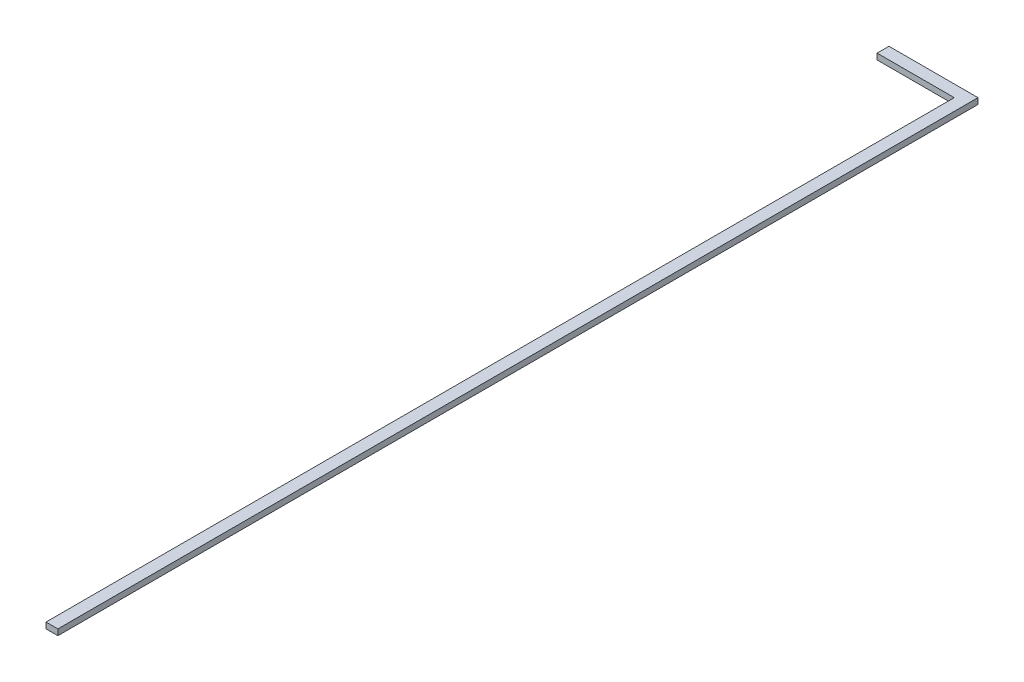
ISO-10303-21;
HEADER;
FILE_DESCRIPTION(('STEP AP214'),'2;1');
FILE_NAME('part.step','',(''),(''),'','','');
FILE_SCHEMA(('AUTOMOTIVE_DESIGN { 1 0 10303 214 1 1 1 1 }'));
ENDSEC;
DATA;
#1=APPLICATION_CONTEXT('core data for automotive mechanical design processes');
#2=APPLICATION_PROTOCOL_DEFINITION('international standard','automotive_design',2000,#1);
#3=PRODUCT_CONTEXT('',#1,'mechanical');
#4=PRODUCT('Part','Part','',(#3));
#5=PRODUCT_RELATED_PRODUCT_CATEGORY('part','',(#4));
#6=PRODUCT_DEFINITION_FORMATION('','',#4);
#7=PRODUCT_DEFINITION_CONTEXT('part definition',#1,'design');
#8=PRODUCT_DEFINITION('design','',#6,#7);
#9=PRODUCT_DEFINITION_SHAPE('','',#8);
#10=(LENGTH_UNIT() NAMED_UNIT(*) SI_UNIT(.MILLI.,.METRE.));
#11=(NAMED_UNIT(*) PLANE_ANGLE_UNIT() SI_UNIT($,.RADIAN.));
#12=(NAMED_UNIT(*) SI_UNIT($,.STERADIAN.) SOLID_ANGLE_UNIT());
#13=UNCERTAINTY_MEASURE_WITH_UNIT(LENGTH_MEASURE(1.E-05),#10,'distance_accuracy_value','');
#14=(GEOMETRIC_REPRESENTATION_CONTEXT(3) GLOBAL_UNCERTAINTY_ASSIGNED_CONTEXT((#13)) GLOBAL_UNIT_ASSIGNED_CONTEXT((#10,
#11,#12)) REPRESENTATION_CONTEXT('',''));
#15=CARTESIAN_POINT('',(0.,0.,0.));
#16=DIRECTION('',(0.,0.,1.));
#17=DIRECTION('',(1.,0.,0.));
#18=AXIS2_PLACEMENT_3D('',#15,#16,#17);
#19=CARTESIAN_POINT('',(0.,10.,0.));
#20=DIRECTION('',(0.,0.,-1.));
#21=DIRECTION('',(-1.,0.,0.));
#22=AXIS2_PLACEMENT_3D('',#19,#20,#21);
#23=PLANE('',#22);
#24=DIRECTION('',(1.,0.,0.));
#25=VECTOR('',#24,1.);
#26=CARTESIAN_POINT('',(0.,0.,0.));
#27=LINE('',#26,#25);
#28=CARTESIAN_POINT('',(0.,0.,0.));
#29=VERTEX_POINT('',#28);
#30=CARTESIAN_POINT('',(130.,0.,0.));
#31=VERTEX_POINT('',#30);
#32=EDGE_CURVE('E115',#29,#31,#27,.T.);
#33=ORIENTED_EDGE('',*,*,#32,.T.);
#34=DIRECTION('',(0.,-1.,0.));
#35=VECTOR('',#34,1.);
#36=CARTESIAN_POINT('',(130.,10.,0.));
#37=LINE('',#36,#35);
#38=CARTESIAN_POINT('',(130.,10.,0.));
#39=VERTEX_POINT('',#38);
#40=EDGE_CURVE('E11',#39,#31,#37,.T.);
#41=ORIENTED_EDGE('',*,*,#40,.F.);
#42=DIRECTION('',(1.,0.,0.));
#43=VECTOR('',#42,1.);
#44=CARTESIAN_POINT('',(0.,10.,0.));
#45=LINE('',#44,#43);
#46=CARTESIAN_POINT('',(0.,10.,0.));
#47=VERTEX_POINT('',#46);
#48=EDGE_CURVE('E125',#47,#39,#45,.T.);
#49=ORIENTED_EDGE('',*,*,#48,.F.);
#50=DIRECTION('',(0.,-1.,0.));
#51=VECTOR('',#50,1.);
#52=CARTESIAN_POINT('',(0.,10.,0.));
#53=LINE('',#52,#51);
#54=EDGE_CURVE('E111',#47,#29,#53,.T.);
#55=ORIENTED_EDGE('',*,*,#54,.T.);
#56=EDGE_LOOP('',(#33,#41,#49,#55));
#57=FACE_BOUND('',#56,.T.);
#58=ADVANCED_FACE('F31',(#57),#23,.F.);
#59=CARTESIAN_POINT('',(130.,10.,0.));
#60=DIRECTION('',(1.,0.,0.));
#61=DIRECTION('',(0.,0.,-1.));
#62=AXIS2_PLACEMENT_3D('',#59,#60,#61);
#63=PLANE('',#62);
#64=DIRECTION('',(0.,0.,1.));
#65=VECTOR('',#64,1.);
#66=CARTESIAN_POINT('',(130.,0.,0.));
#67=LINE('',#66,#65);
#68=CARTESIAN_POINT('',(130.,0.,1530.));
#69=VERTEX_POINT('',#68);
#70=EDGE_CURVE('E118',#31,#69,#67,.T.);
#71=ORIENTED_EDGE('',*,*,#70,.T.);
#72=DIRECTION('',(0.,-1.,0.));
#73=VECTOR('',#72,1.);
#74=CARTESIAN_POINT('',(130.,10.,1530.));
#75=LINE('',#74,#73);
#76=CARTESIAN_POINT('',(130.,10.,1530.));
#77=VERTEX_POINT('',#76);
#78=EDGE_CURVE('E39',#77,#69,#75,.T.);
#79=ORIENTED_EDGE('',*,*,#78,.F.);
#80=DIRECTION('',(0.,0.,1.));
#81=VECTOR('',#80,1.);
#82=CARTESIAN_POINT('',(130.,10.,0.));
#83=LINE('',#82,#81);
#84=EDGE_CURVE('E84',#39,#77,#83,.T.);
#85=ORIENTED_EDGE('',*,*,#84,.F.);
#86=ORIENTED_EDGE('',*,*,#40,.T.);
#87=EDGE_LOOP('',(#71,#79,#85,#86));
#88=FACE_BOUND('',#87,.T.);
#89=ADVANCED_FACE('F149',(#88),#63,.F.);
#90=CARTESIAN_POINT('',(130.,10.,1530.));
#91=DIRECTION('',(0.,0.,-1.));
#92=DIRECTION('',(-1.,0.,0.));
#93=AXIS2_PLACEMENT_3D('',#90,#91,#92);
#94=PLANE('',#93);
#95=DIRECTION('',(1.,0.,0.));
#96=VECTOR('',#95,1.);
#97=CARTESIAN_POINT('',(130.,0.,1530.));
#98=LINE('',#97,#96);
#99=CARTESIAN_POINT('',(150.,0.,1530.));
#100=VERTEX_POINT('',#99);
#101=EDGE_CURVE('E120',#69,#100,#98,.T.);
#102=ORIENTED_EDGE('',*,*,#101,.T.);
#103=DIRECTION('',(0.,-1.,0.));
#104=VECTOR('',#103,1.);
#105=CARTESIAN_POINT('',(150.,10.,1530.));
#106=LINE('',#105,#104);
#107=CARTESIAN_POINT('',(150.,10.,1530.));
#108=VERTEX_POINT('',#107);
#109=EDGE_CURVE('E106',#108,#100,#106,.T.);
#110=ORIENTED_EDGE('',*,*,#109,.F.);
#111=DIRECTION('',(1.,0.,0.));
#112=VECTOR('',#111,1.);
#113=CARTESIAN_POINT('',(130.,10.,1530.));
#114=LINE('',#113,#112);
#115=EDGE_CURVE('E97',#77,#108,#114,.T.);
#116=ORIENTED_EDGE('',*,*,#115,.F.);
#117=ORIENTED_EDGE('',*,*,#78,.T.);
#118=EDGE_LOOP('',(#102,#110,#116,#117));
#119=FACE_BOUND('',#118,.T.);
#120=ADVANCED_FACE('F131',(#119),#94,.F.);
#121=CARTESIAN_POINT('',(150.,10.,-20.));
#122=DIRECTION('',(-1.,0.,0.));
#123=DIRECTION('',(0.,0.,1.));
#124=AXIS2_PLACEMENT_3D('',#121,#122,#123);
#125=PLANE('',#124);
#126=DIRECTION('',(0.,0.,-1.));
#127=VECTOR('',#126,1.);
#128=CARTESIAN_POINT('',(150.,0.,-20.));
#129=LINE('',#128,#127);
#130=CARTESIAN_POINT('',(150.,0.,-20.));
#131=VERTEX_POINT('',#130);
#132=EDGE_CURVE('E105',#100,#131,#129,.T.);
#133=ORIENTED_EDGE('',*,*,#132,.T.);
#134=DIRECTION('',(0.,-1.,0.));
#135=VECTOR('',#134,1.);
#136=CARTESIAN_POINT('',(150.,10.,-20.));
#137=LINE('',#136,#135);
#138=CARTESIAN_POINT('',(150.,10.,-20.));
#139=VERTEX_POINT('',#138);
#140=EDGE_CURVE('E102',#139,#131,#137,.T.);
#141=ORIENTED_EDGE('',*,*,#140,.F.);
#142=DIRECTION('',(0.,0.,-1.));
#143=VECTOR('',#142,1.);
#144=CARTESIAN_POINT('',(150.,10.,-20.));
#145=LINE('',#144,#143);
#146=EDGE_CURVE('E91',#108,#139,#145,.T.);
#147=ORIENTED_EDGE('',*,*,#146,.F.);
#148=ORIENTED_EDGE('',*,*,#109,.T.);
#149=EDGE_LOOP('',(#133,#141,#147,#148));
#150=FACE_BOUND('',#149,.T.);
#151=ADVANCED_FACE('F103',(#150),#125,.F.);
#152=CARTESIAN_POINT('',(0.,10.,-20.));
#153=DIRECTION('',(0.,0.,1.));
#154=DIRECTION('',(1.,0.,0.));
#155=AXIS2_PLACEMENT_3D('',#152,#153,#154);
#156=PLANE('',#155);
#157=DIRECTION('',(-1.,0.,0.));
#158=VECTOR('',#157,1.);
#159=CARTESIAN_POINT('',(0.,0.,-20.));
#160=LINE('',#159,#158);
#161=CARTESIAN_POINT('',(0.,0.,-20.));
#162=VERTEX_POINT('',#161);
#163=EDGE_CURVE('E70',#131,#162,#160,.T.);
#164=ORIENTED_EDGE('',*,*,#163,.T.);
#165=DIRECTION('',(0.,-1.,0.));
#166=VECTOR('',#165,1.);
#167=CARTESIAN_POINT('',(0.,10.,-20.));
#168=LINE('',#167,#166);
#169=CARTESIAN_POINT('',(0.,10.,-20.));
#170=VERTEX_POINT('',#169);
#171=EDGE_CURVE('E107',#170,#162,#168,.T.);
#172=ORIENTED_EDGE('',*,*,#171,.F.);
#173=DIRECTION('',(-1.,0.,0.));
#174=VECTOR('',#173,1.);
#175=CARTESIAN_POINT('',(0.,10.,-20.));
#176=LINE('',#175,#174);
#177=EDGE_CURVE('E95',#139,#170,#176,.T.);
#178=ORIENTED_EDGE('',*,*,#177,.F.);
#179=ORIENTED_EDGE('',*,*,#140,.T.);
#180=EDGE_LOOP('',(#164,#172,#178,#179));
#181=FACE_BOUND('',#180,.T.);
#182=ADVANCED_FACE('F109',(#181),#156,.F.);
#183=CARTESIAN_POINT('',(0.,10.,0.));
#184=DIRECTION('',(1.,0.,0.));
#185=DIRECTION('',(0.,0.,-1.));
#186=AXIS2_PLACEMENT_3D('',#183,#184,#185);
#187=PLANE('',#186);
#188=DIRECTION('',(0.,0.,1.));
#189=VECTOR('',#188,1.);
#190=CARTESIAN_POINT('',(0.,0.,0.));
#191=LINE('',#190,#189);
#192=EDGE_CURVE('E76',#162,#29,#191,.T.);
#193=ORIENTED_EDGE('',*,*,#192,.T.);
#194=ORIENTED_EDGE('',*,*,#54,.F.);
#195=DIRECTION('',(0.,0.,1.));
#196=VECTOR('',#195,1.);
#197=CARTESIAN_POINT('',(0.,10.,0.));
#198=LINE('',#197,#196);
#199=EDGE_CURVE('E47',#170,#47,#198,.T.);
#200=ORIENTED_EDGE('',*,*,#199,.F.);
#201=ORIENTED_EDGE('',*,*,#171,.T.);
#202=EDGE_LOOP('',(#193,#194,#200,#201));
#203=FACE_BOUND('',#202,.T.);
#204=ADVANCED_FACE('F138',(#203),#187,.F.);
#205=CARTESIAN_POINT('',(130.,10.,0.));
#206=DIRECTION('',(0.,-1.,0.));
#207=DIRECTION('',(0.,0.,-1.));
#208=AXIS2_PLACEMENT_3D('',#205,#206,#207);
#209=PLANE('',#208);
#210=ORIENTED_EDGE('',*,*,#48,.T.);
#211=ORIENTED_EDGE('',*,*,#84,.T.);
#212=ORIENTED_EDGE('',*,*,#115,.T.);
#213=ORIENTED_EDGE('',*,*,#146,.T.);
#214=ORIENTED_EDGE('',*,*,#177,.T.);
#215=ORIENTED_EDGE('',*,*,#199,.T.);
#216=EDGE_LOOP('',(#210,#211,#212,#213,#214,#215));
#217=FACE_BOUND('',#216,.T.);
#218=ADVANCED_FACE('F93',(#217),#209,.F.);
#219=CARTESIAN_POINT('',(130.,0.,0.));
#220=DIRECTION('',(0.,-1.,0.));
#221=DIRECTION('',(0.,0.,-1.));
#222=AXIS2_PLACEMENT_3D('',#219,#220,#221);
#223=PLANE('',#222);
#224=ORIENTED_EDGE('',*,*,#32,.F.);
#225=ORIENTED_EDGE('',*,*,#192,.F.);
#226=ORIENTED_EDGE('',*,*,#163,.F.);
#227=ORIENTED_EDGE('',*,*,#132,.F.);
#228=ORIENTED_EDGE('',*,*,#101,.F.);
#229=ORIENTED_EDGE('',*,*,#70,.F.);
#230=EDGE_LOOP('',(#224,#225,#226,#227,#228,#229));
#231=FACE_BOUND('',#230,.T.);
#232=ADVANCED_FACE('F134',(#231),#223,.T.);
#233=CLOSED_SHELL('',(#58,#89,#120,#151,#182,#204,#218,#232));
#234=MANIFOLD_SOLID_BREP('B2',#233);
#235=ADVANCED_BREP_SHAPE_REPRESENTATION('',(#18,#234),#14);
#236=SHAPE_DEFINITION_REPRESENTATION(#9,#235);
ENDSEC;
END-ISO-10303-21;
